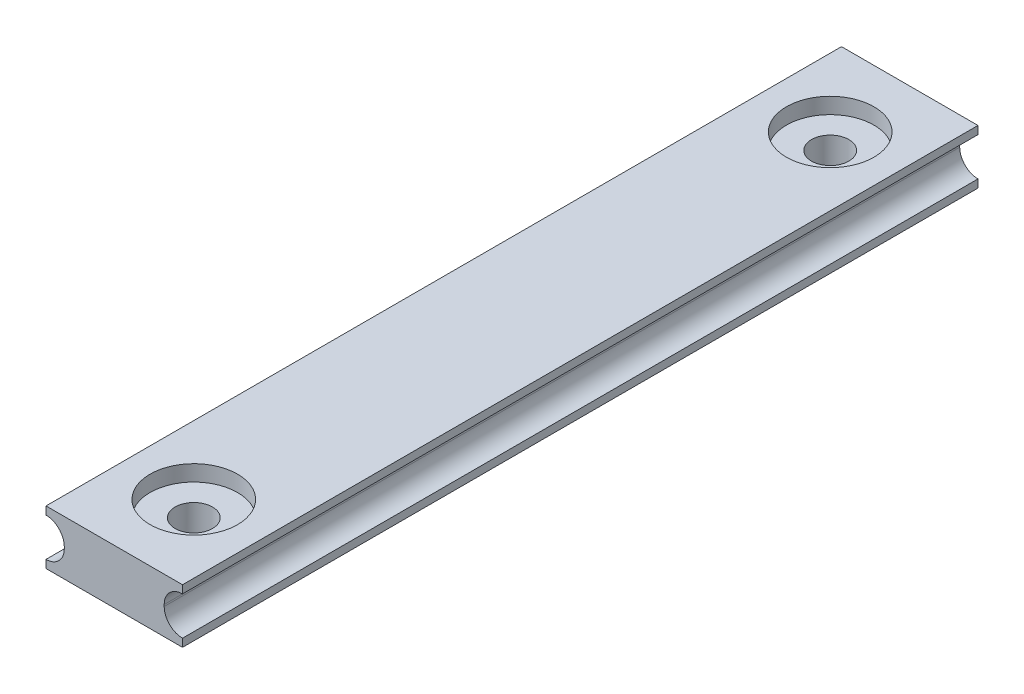
ISO-10303-21;
HEADER;
FILE_DESCRIPTION(('STEP AP214'),'2;1');
FILE_NAME('part.step','',(''),(''),'','','');
FILE_SCHEMA(('AUTOMOTIVE_DESIGN { 1 0 10303 214 1 1 1 1 }'));
ENDSEC;
DATA;
#1=APPLICATION_CONTEXT('core data for automotive mechanical design processes');
#2=APPLICATION_PROTOCOL_DEFINITION('international standard','automotive_design',2000,#1);
#3=PRODUCT_CONTEXT('',#1,'mechanical');
#4=PRODUCT('Part','Part','',(#3));
#5=PRODUCT_RELATED_PRODUCT_CATEGORY('part','',(#4));
#6=PRODUCT_DEFINITION_FORMATION('','',#4);
#7=PRODUCT_DEFINITION_CONTEXT('part definition',#1,'design');
#8=PRODUCT_DEFINITION('design','',#6,#7);
#9=PRODUCT_DEFINITION_SHAPE('','',#8);
#10=(LENGTH_UNIT() NAMED_UNIT(*) SI_UNIT(.MILLI.,.METRE.));
#11=(NAMED_UNIT(*) PLANE_ANGLE_UNIT() SI_UNIT($,.RADIAN.));
#12=(NAMED_UNIT(*) SI_UNIT($,.STERADIAN.) SOLID_ANGLE_UNIT());
#13=UNCERTAINTY_MEASURE_WITH_UNIT(LENGTH_MEASURE(1.E-05),#10,'distance_accuracy_value','');
#14=(GEOMETRIC_REPRESENTATION_CONTEXT(3) GLOBAL_UNCERTAINTY_ASSIGNED_CONTEXT((#13)) GLOBAL_UNIT_ASSIGNED_CONTEXT((#10,
#11,#12)) REPRESENTATION_CONTEXT('',''));
#15=CARTESIAN_POINT('',(0.,0.,0.));
#16=DIRECTION('',(0.,0.,1.));
#17=DIRECTION('',(1.,0.,0.));
#18=AXIS2_PLACEMENT_3D('',#15,#16,#17);
#19=CARTESIAN_POINT('',(-4.29,1.705,25.));
#20=DIRECTION('',(0.,-1.,0.));
#21=DIRECTION('',(0.,0.,-1.));
#22=AXIS2_PLACEMENT_3D('',#19,#20,#21);
#23=PLANE('',#22);
#24=CARTESIAN_POINT('',(0.,1.705,-20.));
#25=DIRECTION('',(0.,1.,0.));
#26=DIRECTION('',(0.,0.,1.));
#27=AXIS2_PLACEMENT_3D('',#24,#25,#26);
#28=CIRCLE('',#27,2.75);
#29=CARTESIAN_POINT('',(0.,1.705,-17.25));
#30=VERTEX_POINT('',#29);
#31=EDGE_CURVE('E212',#30,#30,#28,.T.);
#32=ORIENTED_EDGE('',*,*,#31,.F.);
#33=EDGE_LOOP('',(#32));
#34=FACE_BOUND('',#33,.T.);
#35=DIRECTION('',(-1.,0.,0.));
#36=VECTOR('',#35,1.);
#37=CARTESIAN_POINT('',(-4.29,1.705,-25.));
#38=LINE('',#37,#36);
#39=CARTESIAN_POINT('',(4.29,1.705,-25.));
#40=VERTEX_POINT('',#39);
#41=CARTESIAN_POINT('',(-4.29,1.705,-25.));
#42=VERTEX_POINT('',#41);
#43=EDGE_CURVE('E101',#40,#42,#38,.T.);
#44=ORIENTED_EDGE('',*,*,#43,.T.);
#45=DIRECTION('',(0.,0.,-1.));
#46=VECTOR('',#45,1.);
#47=CARTESIAN_POINT('',(-4.29,1.705,25.));
#48=LINE('',#47,#46);
#49=CARTESIAN_POINT('',(-4.29,1.705,25.));
#50=VERTEX_POINT('',#49);
#51=EDGE_CURVE('E154',#50,#42,#48,.T.);
#52=ORIENTED_EDGE('',*,*,#51,.F.);
#53=DIRECTION('',(-1.,0.,0.));
#54=VECTOR('',#53,1.);
#55=CARTESIAN_POINT('',(-4.29,1.705,25.));
#56=LINE('',#55,#54);
#57=CARTESIAN_POINT('',(4.29,1.705,25.));
#58=VERTEX_POINT('',#57);
#59=EDGE_CURVE('E54',#58,#50,#56,.T.);
#60=ORIENTED_EDGE('',*,*,#59,.F.);
#61=DIRECTION('',(0.,0.,-1.));
#62=VECTOR('',#61,1.);
#63=CARTESIAN_POINT('',(4.29,1.705,25.));
#64=LINE('',#63,#62);
#65=EDGE_CURVE('E150',#58,#40,#64,.T.);
#66=ORIENTED_EDGE('',*,*,#65,.T.);
#67=EDGE_LOOP('',(#44,#52,#60,#66));
#68=FACE_BOUND('',#67,.T.);
#69=CARTESIAN_POINT('',(0.,1.705,20.));
#70=DIRECTION('',(0.,-1.,0.));
#71=DIRECTION('',(0.,0.,-1.));
#72=AXIS2_PLACEMENT_3D('',#69,#70,#71);
#73=CIRCLE('',#72,2.75);
#74=CARTESIAN_POINT('',(0.,1.705,17.25));
#75=VERTEX_POINT('',#74);
#76=EDGE_CURVE('E259',#75,#75,#73,.T.);
#77=ORIENTED_EDGE('',*,*,#76,.T.);
#78=EDGE_LOOP('',(#77));
#79=FACE_BOUND('',#78,.T.);
#80=ADVANCED_FACE('F35',(#34,#68,#79),#23,.F.);
#81=CARTESIAN_POINT('',(0.,-1.705,20.));
#82=DIRECTION('',(0.,1.,0.));
#83=DIRECTION('',(0.,0.,1.));
#84=AXIS2_PLACEMENT_3D('',#81,#82,#83);
#85=CYLINDRICAL_SURFACE('',#84,1.175);
#86=CARTESIAN_POINT('',(0.,-1.705,20.));
#87=DIRECTION('',(0.,-1.,0.));
#88=DIRECTION('',(0.,0.,-1.));
#89=AXIS2_PLACEMENT_3D('',#86,#87,#88);
#90=CIRCLE('',#89,1.175);
#91=CARTESIAN_POINT('',(0.,-1.705,18.825));
#92=VERTEX_POINT('',#91);
#93=EDGE_CURVE('E217',#92,#92,#90,.T.);
#94=ORIENTED_EDGE('',*,*,#93,.T.);
#95=EDGE_LOOP('',(#94));
#96=FACE_BOUND('',#95,.T.);
#97=CARTESIAN_POINT('',(0.,0.705,20.));
#98=DIRECTION('',(0.,1.,0.));
#99=DIRECTION('',(0.,0.,1.));
#100=AXIS2_PLACEMENT_3D('',#97,#98,#99);
#101=CIRCLE('',#100,1.175);
#102=CARTESIAN_POINT('',(0.,0.705,21.175));
#103=VERTEX_POINT('',#102);
#104=EDGE_CURVE('E39',#103,#103,#101,.T.);
#105=ORIENTED_EDGE('',*,*,#104,.T.);
#106=EDGE_LOOP('',(#105));
#107=FACE_BOUND('',#106,.T.);
#108=ADVANCED_FACE('F254',(#96,#107),#85,.F.);
#109=CARTESIAN_POINT('',(-4.29,-1.705,25.));
#110=DIRECTION('',(0.,1.,0.));
#111=DIRECTION('',(0.,0.,1.));
#112=AXIS2_PLACEMENT_3D('',#109,#110,#111);
#113=PLANE('',#112);
#114=DIRECTION('',(1.,0.,0.));
#115=VECTOR('',#114,1.);
#116=CARTESIAN_POINT('',(-4.29,-1.705,-25.));
#117=LINE('',#116,#115);
#118=CARTESIAN_POINT('',(-4.29,-1.705,-25.));
#119=VERTEX_POINT('',#118);
#120=CARTESIAN_POINT('',(4.29,-1.705,-25.));
#121=VERTEX_POINT('',#120);
#122=EDGE_CURVE('E170',#119,#121,#117,.T.);
#123=ORIENTED_EDGE('',*,*,#122,.T.);
#124=DIRECTION('',(0.,0.,-1.));
#125=VECTOR('',#124,1.);
#126=CARTESIAN_POINT('',(4.29,-1.705,25.));
#127=LINE('',#126,#125);
#128=CARTESIAN_POINT('',(4.29,-1.705,25.));
#129=VERTEX_POINT('',#128);
#130=EDGE_CURVE('E191',#129,#121,#127,.T.);
#131=ORIENTED_EDGE('',*,*,#130,.F.);
#132=DIRECTION('',(1.,0.,0.));
#133=VECTOR('',#132,1.);
#134=CARTESIAN_POINT('',(-4.29,-1.705,25.));
#135=LINE('',#134,#133);
#136=CARTESIAN_POINT('',(-4.29,-1.705,25.));
#137=VERTEX_POINT('',#136);
#138=EDGE_CURVE('E230',#137,#129,#135,.T.);
#139=ORIENTED_EDGE('',*,*,#138,.F.);
#140=DIRECTION('',(0.,0.,-1.));
#141=VECTOR('',#140,1.);
#142=CARTESIAN_POINT('',(-4.29,-1.705,25.));
#143=LINE('',#142,#141);
#144=EDGE_CURVE('E194',#137,#119,#143,.T.);
#145=ORIENTED_EDGE('',*,*,#144,.T.);
#146=EDGE_LOOP('',(#123,#131,#139,#145));
#147=FACE_BOUND('',#146,.T.);
#148=CARTESIAN_POINT('',(0.,-1.705,-20.));
#149=DIRECTION('',(0.,1.,0.));
#150=DIRECTION('',(0.,0.,1.));
#151=AXIS2_PLACEMENT_3D('',#148,#149,#150);
#152=CIRCLE('',#151,1.175);
#153=CARTESIAN_POINT('',(0.,-1.705,-18.825));
#154=VERTEX_POINT('',#153);
#155=EDGE_CURVE('E162',#154,#154,#152,.T.);
#156=ORIENTED_EDGE('',*,*,#155,.T.);
#157=EDGE_LOOP('',(#156));
#158=FACE_BOUND('',#157,.T.);
#159=ORIENTED_EDGE('',*,*,#93,.F.);
#160=EDGE_LOOP('',(#159));
#161=FACE_BOUND('',#160,.T.);
#162=ADVANCED_FACE('F273',(#147,#158,#161),#113,.F.);
#163=CARTESIAN_POINT('',(0.,-1.705,-20.));
#164=DIRECTION('',(0.,1.,0.));
#165=DIRECTION('',(0.,0.,1.));
#166=AXIS2_PLACEMENT_3D('',#163,#164,#165);
#167=CYLINDRICAL_SURFACE('',#166,1.175);
#168=ORIENTED_EDGE('',*,*,#155,.F.);
#169=EDGE_LOOP('',(#168));
#170=FACE_BOUND('',#169,.T.);
#171=CARTESIAN_POINT('',(0.,0.705,-20.));
#172=DIRECTION('',(0.,1.,0.));
#173=DIRECTION('',(0.,0.,1.));
#174=AXIS2_PLACEMENT_3D('',#171,#172,#173);
#175=CIRCLE('',#174,1.175);
#176=CARTESIAN_POINT('',(0.,0.705,-18.825));
#177=VERTEX_POINT('',#176);
#178=EDGE_CURVE('E204',#177,#177,#175,.F.);
#179=ORIENTED_EDGE('',*,*,#178,.F.);
#180=EDGE_LOOP('',(#179));
#181=FACE_BOUND('',#180,.T.);
#182=ADVANCED_FACE('F275',(#170,#181),#167,.F.);
#183=CARTESIAN_POINT('',(-4.29,1.705,25.));
#184=DIRECTION('',(1.,0.,0.));
#185=DIRECTION('',(0.,1.,0.));
#186=AXIS2_PLACEMENT_3D('',#183,#184,#185);
#187=PLANE('',#186);
#188=DIRECTION('',(0.,-1.,0.));
#189=VECTOR('',#188,1.);
#190=CARTESIAN_POINT('',(-4.29,1.705,-25.));
#191=LINE('',#190,#189);
#192=CARTESIAN_POINT('',(-4.29,1.205,-25.));
#193=VERTEX_POINT('',#192);
#194=EDGE_CURVE('E158',#42,#193,#191,.T.);
#195=ORIENTED_EDGE('',*,*,#194,.T.);
#196=DIRECTION('',(0.,0.,-1.));
#197=VECTOR('',#196,1.);
#198=CARTESIAN_POINT('',(-4.29,1.205,25.));
#199=LINE('',#198,#197);
#200=CARTESIAN_POINT('',(-4.29,1.205,25.));
#201=VERTEX_POINT('',#200);
#202=EDGE_CURVE('E11',#201,#193,#199,.T.);
#203=ORIENTED_EDGE('',*,*,#202,.F.);
#204=DIRECTION('',(0.,-1.,0.));
#205=VECTOR('',#204,1.);
#206=CARTESIAN_POINT('',(-4.29,1.705,25.));
#207=LINE('',#206,#205);
#208=EDGE_CURVE('E181',#50,#201,#207,.T.);
#209=ORIENTED_EDGE('',*,*,#208,.F.);
#210=ORIENTED_EDGE('',*,*,#51,.T.);
#211=EDGE_LOOP('',(#195,#203,#209,#210));
#212=FACE_BOUND('',#211,.T.);
#213=ADVANCED_FACE('F37',(#212),#187,.F.);
#214=CARTESIAN_POINT('',(-4.29,0.0550000000000001,25.));
#215=DIRECTION('',(0.,0.,-1.));
#216=DIRECTION('',(-1.,0.,0.));
#217=AXIS2_PLACEMENT_3D('',#214,#215,#216);
#218=CYLINDRICAL_SURFACE('',#217,1.15);
#219=CARTESIAN_POINT('',(-4.29,0.0550000000000001,-25.));
#220=DIRECTION('',(0.,0.,-1.));
#221=DIRECTION('',(1.,0.,0.));
#222=AXIS2_PLACEMENT_3D('',#219,#220,#221);
#223=CIRCLE('',#222,1.15);
#224=CARTESIAN_POINT('',(-3.14,0.0550000000000001,-25.));
#225=VERTEX_POINT('',#224);
#226=EDGE_CURVE('E161',#193,#225,#223,.T.);
#227=ORIENTED_EDGE('',*,*,#226,.T.);
#228=DIRECTION('',(0.,0.,-1.));
#229=VECTOR('',#228,1.);
#230=CARTESIAN_POINT('',(-3.14,0.0550000000000001,25.));
#231=LINE('',#230,#229);
#232=CARTESIAN_POINT('',(-3.14,0.0550000000000001,25.));
#233=VERTEX_POINT('',#232);
#234=EDGE_CURVE('E45',#233,#225,#231,.T.);
#235=ORIENTED_EDGE('',*,*,#234,.F.);
#236=CARTESIAN_POINT('',(-4.29,0.0550000000000001,25.));
#237=DIRECTION('',(0.,0.,-1.));
#238=DIRECTION('',(1.,0.,0.));
#239=AXIS2_PLACEMENT_3D('',#236,#237,#238);
#240=CIRCLE('',#239,1.15);
#241=EDGE_CURVE('E109',#201,#233,#240,.T.);
#242=ORIENTED_EDGE('',*,*,#241,.F.);
#243=ORIENTED_EDGE('',*,*,#202,.T.);
#244=EDGE_LOOP('',(#227,#235,#242,#243));
#245=FACE_BOUND('',#244,.T.);
#246=ADVANCED_FACE('F300',(#245),#218,.F.);
#247=CARTESIAN_POINT('',(-3.14,0.0550000000000001,25.));
#248=DIRECTION('',(1.,0.,0.));
#249=DIRECTION('',(0.,0.,-1.));
#250=AXIS2_PLACEMENT_3D('',#247,#248,#249);
#251=PLANE('',#250);
#252=DIRECTION('',(0.,-1.,0.));
#253=VECTOR('',#252,1.);
#254=CARTESIAN_POINT('',(-3.14,0.0550000000000001,-25.));
#255=LINE('',#254,#253);
#256=CARTESIAN_POINT('',(-3.14,-0.0549999999999997,-25.));
#257=VERTEX_POINT('',#256);
#258=EDGE_CURVE('E164',#225,#257,#255,.T.);
#259=ORIENTED_EDGE('',*,*,#258,.T.);
#260=DIRECTION('',(0.,0.,-1.));
#261=VECTOR('',#260,1.);
#262=CARTESIAN_POINT('',(-3.14,-0.0549999999999997,25.));
#263=LINE('',#262,#261);
#264=CARTESIAN_POINT('',(-3.14,-0.0549999999999997,25.));
#265=VERTEX_POINT('',#264);
#266=EDGE_CURVE('E200',#265,#257,#263,.T.);
#267=ORIENTED_EDGE('',*,*,#266,.F.);
#268=DIRECTION('',(0.,-1.,0.));
#269=VECTOR('',#268,1.);
#270=CARTESIAN_POINT('',(-3.14,0.0550000000000001,25.));
#271=LINE('',#270,#269);
#272=EDGE_CURVE('E224',#233,#265,#271,.T.);
#273=ORIENTED_EDGE('',*,*,#272,.F.);
#274=ORIENTED_EDGE('',*,*,#234,.T.);
#275=EDGE_LOOP('',(#259,#267,#273,#274));
#276=FACE_BOUND('',#275,.T.);
#277=ADVANCED_FACE('F297',(#276),#251,.F.);
#278=CARTESIAN_POINT('',(-4.29,-0.0549999999999999,25.));
#279=DIRECTION('',(0.,0.,-1.));
#280=DIRECTION('',(-1.,0.,0.));
#281=AXIS2_PLACEMENT_3D('',#278,#279,#280);
#282=CYLINDRICAL_SURFACE('',#281,1.15);
#283=CARTESIAN_POINT('',(-4.29,-0.0549999999999999,-25.));
#284=DIRECTION('',(0.,0.,-1.));
#285=DIRECTION('',(-1.,0.,0.));
#286=AXIS2_PLACEMENT_3D('',#283,#284,#285);
#287=CIRCLE('',#286,1.15);
#288=CARTESIAN_POINT('',(-4.29,-1.205,-25.));
#289=VERTEX_POINT('',#288);
#290=EDGE_CURVE('E166',#257,#289,#287,.T.);
#291=ORIENTED_EDGE('',*,*,#290,.T.);
#292=DIRECTION('',(0.,0.,-1.));
#293=VECTOR('',#292,1.);
#294=CARTESIAN_POINT('',(-4.29,-1.205,25.));
#295=LINE('',#294,#293);
#296=CARTESIAN_POINT('',(-4.29,-1.205,25.));
#297=VERTEX_POINT('',#296);
#298=EDGE_CURVE('E197',#297,#289,#295,.T.);
#299=ORIENTED_EDGE('',*,*,#298,.F.);
#300=CARTESIAN_POINT('',(-4.29,-0.0549999999999999,25.));
#301=DIRECTION('',(0.,0.,-1.));
#302=DIRECTION('',(-1.,0.,0.));
#303=AXIS2_PLACEMENT_3D('',#300,#301,#302);
#304=CIRCLE('',#303,1.15);
#305=EDGE_CURVE('E226',#265,#297,#304,.T.);
#306=ORIENTED_EDGE('',*,*,#305,.F.);
#307=ORIENTED_EDGE('',*,*,#266,.T.);
#308=EDGE_LOOP('',(#291,#299,#306,#307));
#309=FACE_BOUND('',#308,.T.);
#310=ADVANCED_FACE('F293',(#309),#282,.F.);
#311=CARTESIAN_POINT('',(-4.29,-1.205,25.));
#312=DIRECTION('',(1.,0.,0.));
#313=DIRECTION('',(0.,1.,0.));
#314=AXIS2_PLACEMENT_3D('',#311,#312,#313);
#315=PLANE('',#314);
#316=DIRECTION('',(0.,-1.,0.));
#317=VECTOR('',#316,1.);
#318=CARTESIAN_POINT('',(-4.29,-1.205,-25.));
#319=LINE('',#318,#317);
#320=EDGE_CURVE('E168',#289,#119,#319,.T.);
#321=ORIENTED_EDGE('',*,*,#320,.T.);
#322=ORIENTED_EDGE('',*,*,#144,.F.);
#323=DIRECTION('',(0.,-1.,0.));
#324=VECTOR('',#323,1.);
#325=CARTESIAN_POINT('',(-4.29,-1.205,25.));
#326=LINE('',#325,#324);
#327=EDGE_CURVE('E228',#297,#137,#326,.T.);
#328=ORIENTED_EDGE('',*,*,#327,.F.);
#329=ORIENTED_EDGE('',*,*,#298,.T.);
#330=EDGE_LOOP('',(#321,#322,#328,#329));
#331=FACE_BOUND('',#330,.T.);
#332=ADVANCED_FACE('F290',(#331),#315,.F.);
#333=CARTESIAN_POINT('',(4.29,-1.205,25.));
#334=DIRECTION('',(-1.,0.,0.));
#335=DIRECTION('',(0.,-1.,0.));
#336=AXIS2_PLACEMENT_3D('',#333,#334,#335);
#337=PLANE('',#336);
#338=DIRECTION('',(0.,1.,0.));
#339=VECTOR('',#338,1.);
#340=CARTESIAN_POINT('',(4.29,-1.205,-25.));
#341=LINE('',#340,#339);
#342=CARTESIAN_POINT('',(4.29,-1.205,-25.));
#343=VERTEX_POINT('',#342);
#344=EDGE_CURVE('E172',#121,#343,#341,.T.);
#345=ORIENTED_EDGE('',*,*,#344,.T.);
#346=DIRECTION('',(0.,0.,-1.));
#347=VECTOR('',#346,1.);
#348=CARTESIAN_POINT('',(4.29,-1.205,25.));
#349=LINE('',#348,#347);
#350=CARTESIAN_POINT('',(4.29,-1.205,25.));
#351=VERTEX_POINT('',#350);
#352=EDGE_CURVE('E188',#351,#343,#349,.T.);
#353=ORIENTED_EDGE('',*,*,#352,.F.);
#354=DIRECTION('',(0.,1.,0.));
#355=VECTOR('',#354,1.);
#356=CARTESIAN_POINT('',(4.29,-1.205,25.));
#357=LINE('',#356,#355);
#358=EDGE_CURVE('E232',#129,#351,#357,.T.);
#359=ORIENTED_EDGE('',*,*,#358,.F.);
#360=ORIENTED_EDGE('',*,*,#130,.T.);
#361=EDGE_LOOP('',(#345,#353,#359,#360));
#362=FACE_BOUND('',#361,.T.);
#363=ADVANCED_FACE('F288',(#362),#337,.F.);
#364=CARTESIAN_POINT('',(4.29,-0.0549999999999999,25.));
#365=DIRECTION('',(0.,0.,-1.));
#366=DIRECTION('',(-1.,0.,0.));
#367=AXIS2_PLACEMENT_3D('',#364,#365,#366);
#368=CYLINDRICAL_SURFACE('',#367,1.15);
#369=CARTESIAN_POINT('',(4.29,-0.0549999999999999,-25.));
#370=DIRECTION('',(0.,0.,-1.));
#371=DIRECTION('',(1.,0.,0.));
#372=AXIS2_PLACEMENT_3D('',#369,#370,#371);
#373=CIRCLE('',#372,1.15);
#374=CARTESIAN_POINT('',(3.14,-0.0549999999999999,-25.));
#375=VERTEX_POINT('',#374);
#376=EDGE_CURVE('E174',#343,#375,#373,.T.);
#377=ORIENTED_EDGE('',*,*,#376,.T.);
#378=DIRECTION('',(0.,0.,-1.));
#379=VECTOR('',#378,1.);
#380=CARTESIAN_POINT('',(3.14,-0.0549999999999999,25.));
#381=LINE('',#380,#379);
#382=CARTESIAN_POINT('',(3.14,-0.0549999999999999,25.));
#383=VERTEX_POINT('',#382);
#384=EDGE_CURVE('E185',#383,#375,#381,.T.);
#385=ORIENTED_EDGE('',*,*,#384,.F.);
#386=CARTESIAN_POINT('',(4.29,-0.0549999999999999,25.));
#387=DIRECTION('',(0.,0.,-1.));
#388=DIRECTION('',(1.,0.,0.));
#389=AXIS2_PLACEMENT_3D('',#386,#387,#388);
#390=CIRCLE('',#389,1.15);
#391=EDGE_CURVE('E234',#351,#383,#390,.T.);
#392=ORIENTED_EDGE('',*,*,#391,.F.);
#393=ORIENTED_EDGE('',*,*,#352,.T.);
#394=EDGE_LOOP('',(#377,#385,#392,#393));
#395=FACE_BOUND('',#394,.T.);
#396=ADVANCED_FACE('F240',(#395),#368,.F.);
#397=CARTESIAN_POINT('',(3.14,0.0550000000000001,25.));
#398=DIRECTION('',(-1.,0.,0.));
#399=DIRECTION('',(0.,0.,1.));
#400=AXIS2_PLACEMENT_3D('',#397,#398,#399);
#401=PLANE('',#400);
#402=DIRECTION('',(0.,1.,0.));
#403=VECTOR('',#402,1.);
#404=CARTESIAN_POINT('',(3.14,0.0550000000000001,-25.));
#405=LINE('',#404,#403);
#406=CARTESIAN_POINT('',(3.14,0.0550000000000001,-25.));
#407=VERTEX_POINT('',#406);
#408=EDGE_CURVE('E176',#375,#407,#405,.T.);
#409=ORIENTED_EDGE('',*,*,#408,.T.);
#410=DIRECTION('',(0.,0.,-1.));
#411=VECTOR('',#410,1.);
#412=CARTESIAN_POINT('',(3.14,0.0550000000000001,25.));
#413=LINE('',#412,#411);
#414=CARTESIAN_POINT('',(3.14,0.0550000000000001,25.));
#415=VERTEX_POINT('',#414);
#416=EDGE_CURVE('E149',#415,#407,#413,.T.);
#417=ORIENTED_EDGE('',*,*,#416,.F.);
#418=DIRECTION('',(0.,1.,0.));
#419=VECTOR('',#418,1.);
#420=CARTESIAN_POINT('',(3.14,0.0550000000000001,25.));
#421=LINE('',#420,#419);
#422=EDGE_CURVE('E140',#383,#415,#421,.T.);
#423=ORIENTED_EDGE('',*,*,#422,.F.);
#424=ORIENTED_EDGE('',*,*,#384,.T.);
#425=EDGE_LOOP('',(#409,#417,#423,#424));
#426=FACE_BOUND('',#425,.T.);
#427=ADVANCED_FACE('F244',(#426),#401,.F.);
#428=CARTESIAN_POINT('',(4.29,0.0550000000000001,25.));
#429=DIRECTION('',(0.,0.,-1.));
#430=DIRECTION('',(-1.,0.,0.));
#431=AXIS2_PLACEMENT_3D('',#428,#429,#430);
#432=CYLINDRICAL_SURFACE('',#431,1.15);
#433=CARTESIAN_POINT('',(4.29,0.0550000000000001,-25.));
#434=DIRECTION('',(0.,0.,-1.));
#435=DIRECTION('',(-1.,0.,0.));
#436=AXIS2_PLACEMENT_3D('',#433,#434,#435);
#437=CIRCLE('',#436,1.15);
#438=CARTESIAN_POINT('',(4.29,1.205,-25.));
#439=VERTEX_POINT('',#438);
#440=EDGE_CURVE('E148',#407,#439,#437,.T.);
#441=ORIENTED_EDGE('',*,*,#440,.T.);
#442=DIRECTION('',(0.,0.,-1.));
#443=VECTOR('',#442,1.);
#444=CARTESIAN_POINT('',(4.29,1.205,25.));
#445=LINE('',#444,#443);
#446=CARTESIAN_POINT('',(4.29,1.205,25.));
#447=VERTEX_POINT('',#446);
#448=EDGE_CURVE('E145',#447,#439,#445,.T.);
#449=ORIENTED_EDGE('',*,*,#448,.F.);
#450=CARTESIAN_POINT('',(4.29,0.0550000000000001,25.));
#451=DIRECTION('',(0.,0.,-1.));
#452=DIRECTION('',(-1.,0.,0.));
#453=AXIS2_PLACEMENT_3D('',#450,#451,#452);
#454=CIRCLE('',#453,1.15);
#455=EDGE_CURVE('E134',#415,#447,#454,.T.);
#456=ORIENTED_EDGE('',*,*,#455,.F.);
#457=ORIENTED_EDGE('',*,*,#416,.T.);
#458=EDGE_LOOP('',(#441,#449,#456,#457));
#459=FACE_BOUND('',#458,.T.);
#460=ADVANCED_FACE('F146',(#459),#432,.F.);
#461=CARTESIAN_POINT('',(4.29,1.705,25.));
#462=DIRECTION('',(-1.,0.,0.));
#463=DIRECTION('',(0.,-1.,0.));
#464=AXIS2_PLACEMENT_3D('',#461,#462,#463);
#465=PLANE('',#464);
#466=DIRECTION('',(0.,1.,0.));
#467=VECTOR('',#466,1.);
#468=CARTESIAN_POINT('',(4.29,1.705,-25.));
#469=LINE('',#468,#467);
#470=EDGE_CURVE('E95',#439,#40,#469,.T.);
#471=ORIENTED_EDGE('',*,*,#470,.T.);
#472=ORIENTED_EDGE('',*,*,#65,.F.);
#473=DIRECTION('',(0.,1.,0.));
#474=VECTOR('',#473,1.);
#475=CARTESIAN_POINT('',(4.29,1.705,25.));
#476=LINE('',#475,#474);
#477=EDGE_CURVE('E138',#447,#58,#476,.T.);
#478=ORIENTED_EDGE('',*,*,#477,.F.);
#479=ORIENTED_EDGE('',*,*,#448,.T.);
#480=EDGE_LOOP('',(#471,#472,#478,#479));
#481=FACE_BOUND('',#480,.T.);
#482=ADVANCED_FACE('F152',(#481),#465,.F.);
#483=CARTESIAN_POINT('',(-4.29,0.0550000000000001,25.));
#484=DIRECTION('',(0.,0.,1.));
#485=DIRECTION('',(1.,0.,0.));
#486=AXIS2_PLACEMENT_3D('',#483,#484,#485);
#487=PLANE('',#486);
#488=ORIENTED_EDGE('',*,*,#208,.T.);
#489=ORIENTED_EDGE('',*,*,#241,.T.);
#490=ORIENTED_EDGE('',*,*,#272,.T.);
#491=ORIENTED_EDGE('',*,*,#305,.T.);
#492=ORIENTED_EDGE('',*,*,#327,.T.);
#493=ORIENTED_EDGE('',*,*,#138,.T.);
#494=ORIENTED_EDGE('',*,*,#358,.T.);
#495=ORIENTED_EDGE('',*,*,#391,.T.);
#496=ORIENTED_EDGE('',*,*,#422,.T.);
#497=ORIENTED_EDGE('',*,*,#455,.T.);
#498=ORIENTED_EDGE('',*,*,#477,.T.);
#499=ORIENTED_EDGE('',*,*,#59,.T.);
#500=EDGE_LOOP('',(#488,#489,#490,#491,#492,#493,#494,#495,#496,#497,#498,#499));
#501=FACE_BOUND('',#500,.T.);
#502=ADVANCED_FACE('F136',(#501),#487,.T.);
#503=CARTESIAN_POINT('',(-4.29,0.0550000000000001,-25.));
#504=DIRECTION('',(0.,0.,1.));
#505=DIRECTION('',(1.,0.,0.));
#506=AXIS2_PLACEMENT_3D('',#503,#504,#505);
#507=PLANE('',#506);
#508=ORIENTED_EDGE('',*,*,#194,.F.);
#509=ORIENTED_EDGE('',*,*,#43,.F.);
#510=ORIENTED_EDGE('',*,*,#470,.F.);
#511=ORIENTED_EDGE('',*,*,#440,.F.);
#512=ORIENTED_EDGE('',*,*,#408,.F.);
#513=ORIENTED_EDGE('',*,*,#376,.F.);
#514=ORIENTED_EDGE('',*,*,#344,.F.);
#515=ORIENTED_EDGE('',*,*,#122,.F.);
#516=ORIENTED_EDGE('',*,*,#320,.F.);
#517=ORIENTED_EDGE('',*,*,#290,.F.);
#518=ORIENTED_EDGE('',*,*,#258,.F.);
#519=ORIENTED_EDGE('',*,*,#226,.F.);
#520=EDGE_LOOP('',(#508,#509,#510,#511,#512,#513,#514,#515,#516,#517,#518,#519));
#521=FACE_BOUND('',#520,.T.);
#522=ADVANCED_FACE('F247',(#521),#507,.F.);
#523=CARTESIAN_POINT('',(0.,0.705,-20.));
#524=DIRECTION('',(0.,1.,0.));
#525=DIRECTION('',(0.,0.,1.));
#526=AXIS2_PLACEMENT_3D('',#523,#524,#525);
#527=PLANE('',#526);
#528=CARTESIAN_POINT('',(0.,0.705,-20.));
#529=DIRECTION('',(0.,1.,0.));
#530=DIRECTION('',(0.,0.,1.));
#531=AXIS2_PLACEMENT_3D('',#528,#529,#530);
#532=CIRCLE('',#531,2.75);
#533=CARTESIAN_POINT('',(0.,0.705,-17.25));
#534=VERTEX_POINT('',#533);
#535=EDGE_CURVE('E206',#534,#534,#532,.T.);
#536=ORIENTED_EDGE('',*,*,#535,.T.);
#537=EDGE_LOOP('',(#536));
#538=FACE_BOUND('',#537,.T.);
#539=ORIENTED_EDGE('',*,*,#178,.T.);
#540=EDGE_LOOP('',(#539));
#541=FACE_BOUND('',#540,.T.);
#542=ADVANCED_FACE('F334',(#538,#541),#527,.T.);
#543=CARTESIAN_POINT('',(0.,0.705,-20.));
#544=DIRECTION('',(0.,1.,0.));
#545=DIRECTION('',(0.,0.,1.));
#546=AXIS2_PLACEMENT_3D('',#543,#544,#545);
#547=CYLINDRICAL_SURFACE('',#546,2.75);
#548=ORIENTED_EDGE('',*,*,#535,.F.);
#549=EDGE_LOOP('',(#548));
#550=FACE_BOUND('',#549,.T.);
#551=ORIENTED_EDGE('',*,*,#31,.T.);
#552=EDGE_LOOP('',(#551));
#553=FACE_BOUND('',#552,.T.);
#554=ADVANCED_FACE('F337',(#550,#553),#547,.F.);
#555=CARTESIAN_POINT('',(0.,0.705,20.));
#556=DIRECTION('',(0.,1.,0.));
#557=DIRECTION('',(0.,0.,1.));
#558=AXIS2_PLACEMENT_3D('',#555,#556,#557);
#559=CYLINDRICAL_SURFACE('',#558,2.75);
#560=CARTESIAN_POINT('',(0.,0.705,20.));
#561=DIRECTION('',(0.,-1.,0.));
#562=DIRECTION('',(0.,0.,-1.));
#563=AXIS2_PLACEMENT_3D('',#560,#561,#562);
#564=CIRCLE('',#563,2.75);
#565=CARTESIAN_POINT('',(0.,0.705,17.25));
#566=VERTEX_POINT('',#565);
#567=EDGE_CURVE('E261',#566,#566,#564,.T.);
#568=ORIENTED_EDGE('',*,*,#567,.T.);
#569=EDGE_LOOP('',(#568));
#570=FACE_BOUND('',#569,.T.);
#571=ORIENTED_EDGE('',*,*,#76,.F.);
#572=EDGE_LOOP('',(#571));
#573=FACE_BOUND('',#572,.T.);
#574=ADVANCED_FACE('F340',(#570,#573),#559,.F.);
#575=CARTESIAN_POINT('',(0.,0.705,20.));
#576=DIRECTION('',(0.,1.,0.));
#577=DIRECTION('',(0.,0.,-1.));
#578=AXIS2_PLACEMENT_3D('',#575,#576,#577);
#579=PLANE('',#578);
#580=ORIENTED_EDGE('',*,*,#104,.F.);
#581=EDGE_LOOP('',(#580));
#582=FACE_BOUND('',#581,.T.);
#583=ORIENTED_EDGE('',*,*,#567,.F.);
#584=EDGE_LOOP('',(#583));
#585=FACE_BOUND('',#584,.T.);
#586=ADVANCED_FACE('F346',(#582,#585),#579,.T.);
#587=CLOSED_SHELL('',(#80,#108,#162,#182,#213,#246,#277,#310,#332,#363,#396,#427,#460,#482,#502,
#522,#542,#554,#574,#586));
#588=MANIFOLD_SOLID_BREP('B2',#587);
#589=ADVANCED_BREP_SHAPE_REPRESENTATION('',(#18,#588),#14);
#590=SHAPE_DEFINITION_REPRESENTATION(#9,#589);
ENDSEC;
END-ISO-10303-21;
